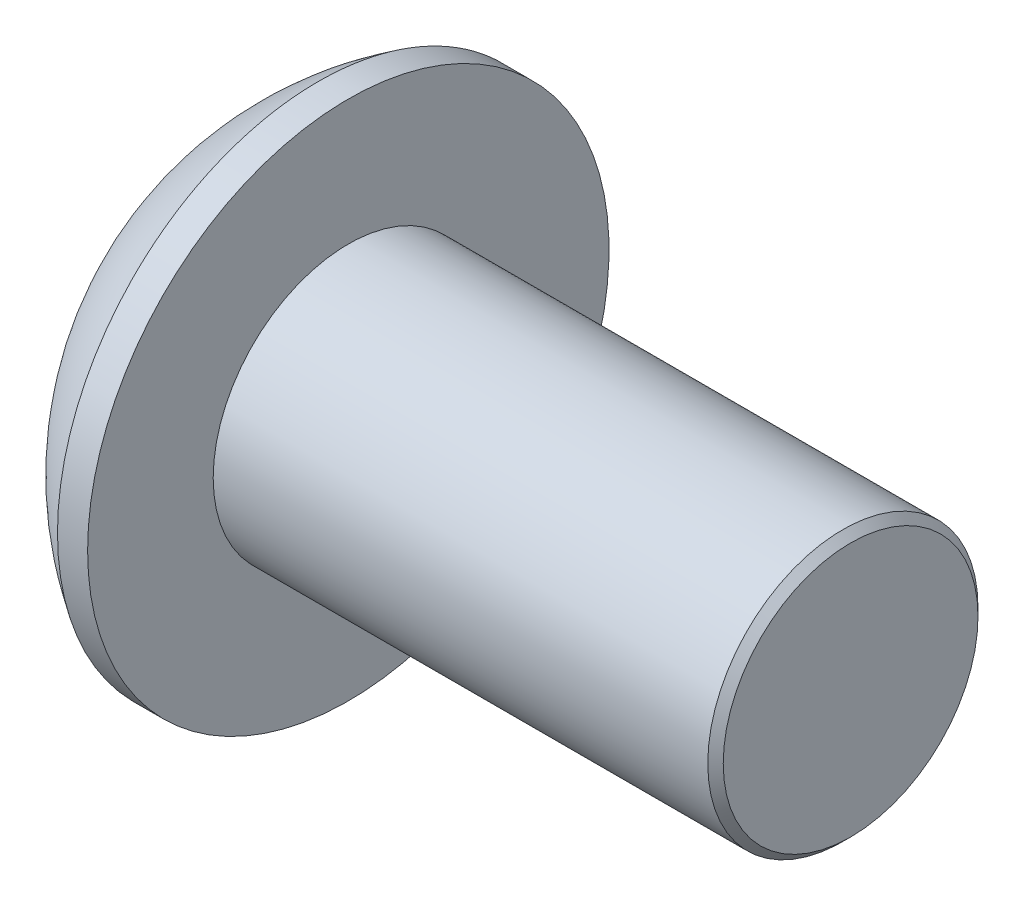
ISO-10303-21;
HEADER;
FILE_DESCRIPTION(('STEP AP214'),'2;1');
FILE_NAME('part.step','',(''),(''),'','','');
FILE_SCHEMA(('AUTOMOTIVE_DESIGN { 1 0 10303 214 1 1 1 1 }'));
ENDSEC;
DATA;
#1=APPLICATION_CONTEXT('core data for automotive mechanical design processes');
#2=APPLICATION_PROTOCOL_DEFINITION('international standard','automotive_design',2000,#1);
#3=PRODUCT_CONTEXT('',#1,'mechanical');
#4=PRODUCT('Part','Part','',(#3));
#5=PRODUCT_RELATED_PRODUCT_CATEGORY('part','',(#4));
#6=PRODUCT_DEFINITION_FORMATION('','',#4);
#7=PRODUCT_DEFINITION_CONTEXT('part definition',#1,'design');
#8=PRODUCT_DEFINITION('design','',#6,#7);
#9=PRODUCT_DEFINITION_SHAPE('','',#8);
#10=(LENGTH_UNIT() NAMED_UNIT(*) SI_UNIT(.MILLI.,.METRE.));
#11=(NAMED_UNIT(*) PLANE_ANGLE_UNIT() SI_UNIT($,.RADIAN.));
#12=(NAMED_UNIT(*) SI_UNIT($,.STERADIAN.) SOLID_ANGLE_UNIT());
#13=UNCERTAINTY_MEASURE_WITH_UNIT(LENGTH_MEASURE(1.E-05),#10,'distance_accuracy_value','');
#14=(GEOMETRIC_REPRESENTATION_CONTEXT(3) GLOBAL_UNCERTAINTY_ASSIGNED_CONTEXT((#13)) GLOBAL_UNIT_ASSIGNED_CONTEXT((#10,
#11,#12)) REPRESENTATION_CONTEXT('',''));
#15=CARTESIAN_POINT('',(0.,0.,0.));
#16=DIRECTION('',(0.,0.,1.));
#17=DIRECTION('',(1.,0.,0.));
#18=AXIS2_PLACEMENT_3D('',#15,#16,#17);
#19=CARTESIAN_POINT('',(1.32080000000034,0.,0.));
#20=DIRECTION('',(-1.,0.,0.));
#21=DIRECTION('',(0.,0.,1.));
#22=AXIS2_PLACEMENT_3D('',#19,#20,#21);
#23=CONICAL_SURFACE('',#22,1.1937999999998,1.04719755119608);
#24=CARTESIAN_POINT('',(2.01004075135902,0.,4.44089209850063E-13));
#25=VERTEX_POINT('',#24);
#26=VERTEX_LOOP('',#25);
#27=FACE_BOUND('',#26,.T.);
#28=CARTESIAN_POINT('',(1.32080000000009,0.,0.));
#29=DIRECTION('',(-1.,0.,0.));
#30=DIRECTION('',(0.,0.,1.));
#31=AXIS2_PLACEMENT_3D('',#28,#29,#30);
#32=CIRCLE('',#31,1.19380000000024);
#33=CARTESIAN_POINT('',(1.32080000000004,0.,1.19380000000012));
#34=VERTEX_POINT('',#33);
#35=CARTESIAN_POINT('',(1.32080000000004,-1.03386112703797,0.596900000000061));
#36=VERTEX_POINT('',#35);
#37=EDGE_CURVE('E20',#34,#36,#32,.F.);
#38=ORIENTED_EDGE('',*,*,#37,.F.);
#39=CARTESIAN_POINT('',(1.32080000000009,0.,0.));
#40=DIRECTION('',(-1.,0.,0.));
#41=DIRECTION('',(0.,0.,1.));
#42=AXIS2_PLACEMENT_3D('',#39,#40,#41);
#43=CIRCLE('',#42,1.19380000000024);
#44=CARTESIAN_POINT('',(1.32080000000004,1.03386112703797,0.596900000000063));
#45=VERTEX_POINT('',#44);
#46=EDGE_CURVE('E90',#45,#34,#43,.F.);
#47=ORIENTED_EDGE('',*,*,#46,.F.);
#48=CARTESIAN_POINT('',(1.32080000000009,0.,0.));
#49=DIRECTION('',(-1.,0.,0.));
#50=DIRECTION('',(0.,0.,1.));
#51=AXIS2_PLACEMENT_3D('',#48,#49,#50);
#52=CIRCLE('',#51,1.19380000000024);
#53=CARTESIAN_POINT('',(1.32080000000004,1.03386112703797,-0.596900000000063));
#54=VERTEX_POINT('',#53);
#55=EDGE_CURVE('E106',#54,#45,#52,.F.);
#56=ORIENTED_EDGE('',*,*,#55,.F.);
#57=CARTESIAN_POINT('',(1.32080000000009,0.,0.));
#58=DIRECTION('',(-1.,0.,0.));
#59=DIRECTION('',(0.,0.,1.));
#60=AXIS2_PLACEMENT_3D('',#57,#58,#59);
#61=CIRCLE('',#60,1.19380000000024);
#62=CARTESIAN_POINT('',(1.32080000000004,1.49420287879031E-12,-1.19380000000012));
#63=VERTEX_POINT('',#62);
#64=EDGE_CURVE('E444',#63,#54,#61,.F.);
#65=ORIENTED_EDGE('',*,*,#64,.F.);
#66=CARTESIAN_POINT('',(1.32080000000009,0.,0.));
#67=DIRECTION('',(-1.,0.,0.));
#68=DIRECTION('',(0.,0.,1.));
#69=AXIS2_PLACEMENT_3D('',#66,#67,#68);
#70=CIRCLE('',#69,1.19380000000024);
#71=CARTESIAN_POINT('',(1.32080000000004,-1.03386112703797,-0.596900000000062));
#72=VERTEX_POINT('',#71);
#73=EDGE_CURVE('E447',#72,#63,#70,.F.);
#74=ORIENTED_EDGE('',*,*,#73,.F.);
#75=CARTESIAN_POINT('',(1.32080000000009,0.,0.));
#76=DIRECTION('',(-1.,0.,0.));
#77=DIRECTION('',(0.,0.,1.));
#78=AXIS2_PLACEMENT_3D('',#75,#76,#77);
#79=CIRCLE('',#78,1.19380000000024);
#80=EDGE_CURVE('E93',#36,#72,#79,.F.);
#81=ORIENTED_EDGE('',*,*,#80,.F.);
#82=EDGE_LOOP('',(#38,#47,#56,#65,#74,#81));
#83=FACE_BOUND('',#82,.T.);
#84=ADVANCED_FACE('F17',(#27,#83),#23,.F.);
#85=CARTESIAN_POINT('',(1.3208,0.,2.3876));
#86=DIRECTION('',(-1.,0.,0.));
#87=DIRECTION('',(0.,0.,1.));
#88=AXIS2_PLACEMENT_3D('',#85,#86,#87);
#89=PLANE('',#88);
#90=DIRECTION('',(0.,1.,0.));
#91=VECTOR('',#90,1.);
#92=CARTESIAN_POINT('',(1.3208,-0.689240751358576,1.1938));
#93=LINE('',#92,#91);
#94=CARTESIAN_POINT('',(1.3208,-0.689240751358576,1.1938));
#95=VERTEX_POINT('',#94);
#96=EDGE_CURVE('E109',#34,#95,#93,.F.);
#97=ORIENTED_EDGE('',*,*,#96,.F.);
#98=ORIENTED_EDGE('',*,*,#37,.T.);
#99=DIRECTION('',(0.,0.5,0.866025403784439));
#100=VECTOR('',#99,1.);
#101=CARTESIAN_POINT('',(1.3208,-1.37848150271715,0.));
#102=LINE('',#101,#100);
#103=EDGE_CURVE('E112',#95,#36,#102,.F.);
#104=ORIENTED_EDGE('',*,*,#103,.F.);
#105=EDGE_LOOP('',(#97,#98,#104));
#106=FACE_BOUND('',#105,.T.);
#107=ADVANCED_FACE('F110',(#106),#89,.T.);
#108=CARTESIAN_POINT('',(1.3208,0.,2.3876));
#109=DIRECTION('',(-1.,0.,0.));
#110=DIRECTION('',(0.,0.,1.));
#111=AXIS2_PLACEMENT_3D('',#108,#109,#110);
#112=PLANE('',#111);
#113=DIRECTION('',(0.,0.5,0.866025403784439));
#114=VECTOR('',#113,1.);
#115=CARTESIAN_POINT('',(1.3208,-1.37848150271715,0.));
#116=LINE('',#115,#114);
#117=CARTESIAN_POINT('',(1.3208,-1.37848150271715,0.));
#118=VERTEX_POINT('',#117);
#119=EDGE_CURVE('E172',#36,#118,#116,.F.);
#120=ORIENTED_EDGE('',*,*,#119,.F.);
#121=ORIENTED_EDGE('',*,*,#80,.T.);
#122=DIRECTION('',(0.,-0.5,0.866025403784439));
#123=VECTOR('',#122,1.);
#124=CARTESIAN_POINT('',(1.3208,-0.689240751358576,-1.1938));
#125=LINE('',#124,#123);
#126=EDGE_CURVE('E160',#118,#72,#125,.F.);
#127=ORIENTED_EDGE('',*,*,#126,.F.);
#128=EDGE_LOOP('',(#120,#121,#127));
#129=FACE_BOUND('',#128,.T.);
#130=ADVANCED_FACE('F249',(#129),#112,.T.);
#131=CARTESIAN_POINT('',(1.3208,0.,2.3876));
#132=DIRECTION('',(-1.,0.,0.));
#133=DIRECTION('',(0.,0.,1.));
#134=AXIS2_PLACEMENT_3D('',#131,#132,#133);
#135=PLANE('',#134);
#136=DIRECTION('',(0.,-0.5,0.866025403784439));
#137=VECTOR('',#136,1.);
#138=CARTESIAN_POINT('',(1.3208,-0.689240751358576,-1.1938));
#139=LINE('',#138,#137);
#140=CARTESIAN_POINT('',(1.3208,-0.689240751358576,-1.1938));
#141=VERTEX_POINT('',#140);
#142=EDGE_CURVE('E157',#72,#141,#139,.F.);
#143=ORIENTED_EDGE('',*,*,#142,.F.);
#144=ORIENTED_EDGE('',*,*,#73,.T.);
#145=DIRECTION('',(0.,-1.,0.));
#146=VECTOR('',#145,1.);
#147=CARTESIAN_POINT('',(1.3208,0.689240751358575,-1.1938));
#148=LINE('',#147,#146);
#149=EDGE_CURVE('E144',#141,#63,#148,.F.);
#150=ORIENTED_EDGE('',*,*,#149,.F.);
#151=EDGE_LOOP('',(#143,#144,#150));
#152=FACE_BOUND('',#151,.T.);
#153=ADVANCED_FACE('F245',(#152),#135,.T.);
#154=CARTESIAN_POINT('',(1.3208,0.,2.3876));
#155=DIRECTION('',(-1.,0.,0.));
#156=DIRECTION('',(0.,0.,1.));
#157=AXIS2_PLACEMENT_3D('',#154,#155,#156);
#158=PLANE('',#157);
#159=DIRECTION('',(0.,-1.,0.));
#160=VECTOR('',#159,1.);
#161=CARTESIAN_POINT('',(1.3208,0.689240751358575,-1.1938));
#162=LINE('',#161,#160);
#163=CARTESIAN_POINT('',(1.3208,0.689240751358575,-1.1938));
#164=VERTEX_POINT('',#163);
#165=EDGE_CURVE('E141',#63,#164,#162,.F.);
#166=ORIENTED_EDGE('',*,*,#165,.F.);
#167=ORIENTED_EDGE('',*,*,#64,.T.);
#168=DIRECTION('',(0.,-0.500000000000001,-0.866025403784438));
#169=VECTOR('',#168,1.);
#170=CARTESIAN_POINT('',(1.3208,1.37848150271715,0.));
#171=LINE('',#170,#169);
#172=EDGE_CURVE('E129',#164,#54,#171,.F.);
#173=ORIENTED_EDGE('',*,*,#172,.F.);
#174=EDGE_LOOP('',(#166,#167,#173));
#175=FACE_BOUND('',#174,.T.);
#176=ADVANCED_FACE('F241',(#175),#158,.T.);
#177=CARTESIAN_POINT('',(1.3208,0.,2.3876));
#178=DIRECTION('',(-1.,0.,0.));
#179=DIRECTION('',(0.,0.,1.));
#180=AXIS2_PLACEMENT_3D('',#177,#178,#179);
#181=PLANE('',#180);
#182=DIRECTION('',(0.,-0.500000000000001,-0.866025403784438));
#183=VECTOR('',#182,1.);
#184=CARTESIAN_POINT('',(1.3208,1.37848150271715,0.));
#185=LINE('',#184,#183);
#186=CARTESIAN_POINT('',(1.3208,1.37848150271715,0.));
#187=VERTEX_POINT('',#186);
#188=EDGE_CURVE('E126',#54,#187,#185,.F.);
#189=ORIENTED_EDGE('',*,*,#188,.F.);
#190=ORIENTED_EDGE('',*,*,#55,.T.);
#191=DIRECTION('',(0.,0.500000000000001,-0.866025403784438));
#192=VECTOR('',#191,1.);
#193=CARTESIAN_POINT('',(1.3208,0.689240751358575,1.1938));
#194=LINE('',#193,#192);
#195=EDGE_CURVE('E149',#187,#45,#194,.F.);
#196=ORIENTED_EDGE('',*,*,#195,.F.);
#197=EDGE_LOOP('',(#189,#190,#196));
#198=FACE_BOUND('',#197,.T.);
#199=ADVANCED_FACE('F238',(#198),#181,.T.);
#200=CARTESIAN_POINT('',(1.3208,0.,2.3876));
#201=DIRECTION('',(-1.,0.,0.));
#202=DIRECTION('',(0.,0.,1.));
#203=AXIS2_PLACEMENT_3D('',#200,#201,#202);
#204=PLANE('',#203);
#205=DIRECTION('',(0.,0.500000000000001,-0.866025403784438));
#206=VECTOR('',#205,1.);
#207=CARTESIAN_POINT('',(1.3208,0.689240751358575,1.1938));
#208=LINE('',#207,#206);
#209=CARTESIAN_POINT('',(1.3208,0.689240751358575,1.1938));
#210=VERTEX_POINT('',#209);
#211=EDGE_CURVE('E104',#45,#210,#208,.F.);
#212=ORIENTED_EDGE('',*,*,#211,.F.);
#213=ORIENTED_EDGE('',*,*,#46,.T.);
#214=DIRECTION('',(0.,1.,0.));
#215=VECTOR('',#214,1.);
#216=CARTESIAN_POINT('',(1.3208,-0.689240751358576,1.1938));
#217=LINE('',#216,#215);
#218=EDGE_CURVE('E101',#210,#34,#217,.F.);
#219=ORIENTED_EDGE('',*,*,#218,.F.);
#220=EDGE_LOOP('',(#212,#213,#219));
#221=FACE_BOUND('',#220,.T.);
#222=ADVANCED_FACE('F99',(#221),#204,.T.);
#223=CARTESIAN_POINT('',(1.3208,-0.689240751358576,1.1938));
#224=DIRECTION('',(0.,0.,-1.));
#225=DIRECTION('',(0.,1.,0.));
#226=AXIS2_PLACEMENT_3D('',#223,#224,#225);
#227=PLANE('',#226);
#228=DIRECTION('',(0.,1.,0.));
#229=VECTOR('',#228,1.);
#230=CARTESIAN_POINT('',(0.,0.,1.1938));
#231=LINE('',#230,#229);
#232=CARTESIAN_POINT('',(0.,0.689240751358575,1.1938));
#233=VERTEX_POINT('',#232);
#234=CARTESIAN_POINT('',(0.,-0.689240751358576,1.1938));
#235=VERTEX_POINT('',#234);
#236=EDGE_CURVE('E133',#233,#235,#231,.F.);
#237=ORIENTED_EDGE('',*,*,#236,.F.);
#238=DIRECTION('',(1.,0.,0.));
#239=VECTOR('',#238,1.);
#240=CARTESIAN_POINT('',(1.3208,0.689240751358575,1.1938));
#241=LINE('',#240,#239);
#242=EDGE_CURVE('E118',#210,#233,#241,.F.);
#243=ORIENTED_EDGE('',*,*,#242,.F.);
#244=ORIENTED_EDGE('',*,*,#218,.T.);
#245=ORIENTED_EDGE('',*,*,#96,.T.);
#246=DIRECTION('',(1.,0.,0.));
#247=VECTOR('',#246,1.);
#248=CARTESIAN_POINT('',(1.3208,-0.689240751358576,1.1938));
#249=LINE('',#248,#247);
#250=EDGE_CURVE('E169',#235,#95,#249,.T.);
#251=ORIENTED_EDGE('',*,*,#250,.F.);
#252=EDGE_LOOP('',(#237,#243,#244,#245,#251));
#253=FACE_BOUND('',#252,.T.);
#254=ADVANCED_FACE('F116',(#253),#227,.T.);
#255=CARTESIAN_POINT('',(1.3208,-1.37848150271715,0.));
#256=DIRECTION('',(0.,0.866025403784439,-0.5));
#257=DIRECTION('',(0.,0.5,0.866025403784439));
#258=AXIS2_PLACEMENT_3D('',#255,#256,#257);
#259=PLANE('',#258);
#260=DIRECTION('',(0.,-0.5,-0.866025403784439));
#261=VECTOR('',#260,1.);
#262=CARTESIAN_POINT('',(0.,-0.689240751358576,1.1938));
#263=LINE('',#262,#261);
#264=CARTESIAN_POINT('',(0.,-1.37848150271715,0.));
#265=VERTEX_POINT('',#264);
#266=EDGE_CURVE('E431',#235,#265,#263,.T.);
#267=ORIENTED_EDGE('',*,*,#266,.F.);
#268=ORIENTED_EDGE('',*,*,#250,.T.);
#269=ORIENTED_EDGE('',*,*,#103,.T.);
#270=ORIENTED_EDGE('',*,*,#119,.T.);
#271=DIRECTION('',(1.,0.,0.));
#272=VECTOR('',#271,1.);
#273=CARTESIAN_POINT('',(1.3208,-1.37848150271715,0.));
#274=LINE('',#273,#272);
#275=EDGE_CURVE('E154',#265,#118,#274,.T.);
#276=ORIENTED_EDGE('',*,*,#275,.F.);
#277=EDGE_LOOP('',(#267,#268,#269,#270,#276));
#278=FACE_BOUND('',#277,.T.);
#279=ADVANCED_FACE('F229',(#278),#259,.T.);
#280=CARTESIAN_POINT('',(1.3208,-0.689240751358576,-1.1938));
#281=DIRECTION('',(0.,0.866025403784439,0.5));
#282=DIRECTION('',(0.,-0.5,0.866025403784439));
#283=AXIS2_PLACEMENT_3D('',#280,#281,#282);
#284=PLANE('',#283);
#285=DIRECTION('',(0.,0.5,-0.866025403784439));
#286=VECTOR('',#285,1.);
#287=CARTESIAN_POINT('',(0.,-1.37848150271715,0.));
#288=LINE('',#287,#286);
#289=CARTESIAN_POINT('',(0.,-0.689240751358576,-1.1938));
#290=VERTEX_POINT('',#289);
#291=EDGE_CURVE('E428',#265,#290,#288,.T.);
#292=ORIENTED_EDGE('',*,*,#291,.F.);
#293=ORIENTED_EDGE('',*,*,#275,.T.);
#294=ORIENTED_EDGE('',*,*,#126,.T.);
#295=ORIENTED_EDGE('',*,*,#142,.T.);
#296=DIRECTION('',(1.,0.,0.));
#297=VECTOR('',#296,1.);
#298=CARTESIAN_POINT('',(1.3208,-0.689240751358576,-1.1938));
#299=LINE('',#298,#297);
#300=EDGE_CURVE('E138',#290,#141,#299,.T.);
#301=ORIENTED_EDGE('',*,*,#300,.F.);
#302=EDGE_LOOP('',(#292,#293,#294,#295,#301));
#303=FACE_BOUND('',#302,.T.);
#304=ADVANCED_FACE('F225',(#303),#284,.T.);
#305=CARTESIAN_POINT('',(1.3208,0.689240751358575,-1.1938));
#306=DIRECTION('',(0.,0.,1.));
#307=DIRECTION('',(0.,-1.,0.));
#308=AXIS2_PLACEMENT_3D('',#305,#306,#307);
#309=PLANE('',#308);
#310=DIRECTION('',(0.,1.,0.));
#311=VECTOR('',#310,1.);
#312=CARTESIAN_POINT('',(0.,0.,-1.1938));
#313=LINE('',#312,#311);
#314=CARTESIAN_POINT('',(0.,0.689240751358575,-1.1938));
#315=VERTEX_POINT('',#314);
#316=EDGE_CURVE('E425',#290,#315,#313,.T.);
#317=ORIENTED_EDGE('',*,*,#316,.F.);
#318=ORIENTED_EDGE('',*,*,#300,.T.);
#319=ORIENTED_EDGE('',*,*,#149,.T.);
#320=ORIENTED_EDGE('',*,*,#165,.T.);
#321=DIRECTION('',(1.,0.,0.));
#322=VECTOR('',#321,1.);
#323=CARTESIAN_POINT('',(1.3208,0.689240751358575,-1.1938));
#324=LINE('',#323,#322);
#325=EDGE_CURVE('E128',#315,#164,#324,.T.);
#326=ORIENTED_EDGE('',*,*,#325,.F.);
#327=EDGE_LOOP('',(#317,#318,#319,#320,#326));
#328=FACE_BOUND('',#327,.T.);
#329=ADVANCED_FACE('F222',(#328),#309,.T.);
#330=CARTESIAN_POINT('',(1.3208,1.37848150271715,0.));
#331=DIRECTION('',(0.,-0.866025403784438,0.500000000000001));
#332=DIRECTION('',(0.,-0.500000000000001,-0.866025403784438));
#333=AXIS2_PLACEMENT_3D('',#330,#331,#332);
#334=PLANE('',#333);
#335=DIRECTION('',(0.,0.500000000000001,0.866025403784438));
#336=VECTOR('',#335,1.);
#337=CARTESIAN_POINT('',(0.,0.689240751358575,-1.1938));
#338=LINE('',#337,#336);
#339=CARTESIAN_POINT('',(0.,1.37848150271715,0.));
#340=VERTEX_POINT('',#339);
#341=EDGE_CURVE('E422',#315,#340,#338,.T.);
#342=ORIENTED_EDGE('',*,*,#341,.F.);
#343=ORIENTED_EDGE('',*,*,#325,.T.);
#344=ORIENTED_EDGE('',*,*,#172,.T.);
#345=ORIENTED_EDGE('',*,*,#188,.T.);
#346=DIRECTION('',(1.,0.,0.));
#347=VECTOR('',#346,1.);
#348=CARTESIAN_POINT('',(1.3208,1.37848150271715,0.));
#349=LINE('',#348,#347);
#350=EDGE_CURVE('E35',#340,#187,#349,.T.);
#351=ORIENTED_EDGE('',*,*,#350,.F.);
#352=EDGE_LOOP('',(#342,#343,#344,#345,#351));
#353=FACE_BOUND('',#352,.T.);
#354=ADVANCED_FACE('F218',(#353),#334,.T.);
#355=CARTESIAN_POINT('',(1.3208,0.689240751358575,1.1938));
#356=DIRECTION('',(0.,-0.866025403784438,-0.500000000000001));
#357=DIRECTION('',(0.,0.500000000000001,-0.866025403784438));
#358=AXIS2_PLACEMENT_3D('',#355,#356,#357);
#359=PLANE('',#358);
#360=DIRECTION('',(0.,-0.500000000000001,0.866025403784438));
#361=VECTOR('',#360,1.);
#362=CARTESIAN_POINT('',(0.,1.37848150271715,0.));
#363=LINE('',#362,#361);
#364=EDGE_CURVE('E204',#340,#233,#363,.T.);
#365=ORIENTED_EDGE('',*,*,#364,.F.);
#366=ORIENTED_EDGE('',*,*,#350,.T.);
#367=ORIENTED_EDGE('',*,*,#195,.T.);
#368=ORIENTED_EDGE('',*,*,#211,.T.);
#369=ORIENTED_EDGE('',*,*,#242,.T.);
#370=EDGE_LOOP('',(#365,#366,#367,#368,#369));
#371=FACE_BOUND('',#370,.T.);
#372=ADVANCED_FACE('F214',(#371),#359,.T.);
#373=CARTESIAN_POINT('',(0.,0.,0.));
#374=DIRECTION('',(-1.,0.,0.));
#375=DIRECTION('',(0.,0.,1.));
#376=AXIS2_PLACEMENT_3D('',#373,#374,#375);
#377=PLANE('',#376);
#378=ORIENTED_EDGE('',*,*,#341,.T.);
#379=ORIENTED_EDGE('',*,*,#364,.T.);
#380=ORIENTED_EDGE('',*,*,#236,.T.);
#381=ORIENTED_EDGE('',*,*,#266,.T.);
#382=ORIENTED_EDGE('',*,*,#291,.T.);
#383=ORIENTED_EDGE('',*,*,#316,.T.);
#384=EDGE_LOOP('',(#378,#379,#380,#381,#382,#383));
#385=FACE_BOUND('',#384,.T.);
#386=CARTESIAN_POINT('',(0.,1.647825,0.));
#387=CARTESIAN_POINT('',(1.62843325243939E-13,1.64781976319874,0.0924902039777531));
#388=CARTESIAN_POINT('',(1.32817714039063E-13,1.63999511633709,0.18514501432637));
#389=CARTESIAN_POINT('',(0.,1.6167119250047,0.322075808080014));
#390=CARTESIAN_POINT('',(-1.58022641874245E-13,1.60700618770234,0.367435533396361));
#391=CARTESIAN_POINT('',(1.59018859991811E-13,1.58380101865853,0.45722093569514));
#392=CARTESIAN_POINT('',(5.68558332013136E-13,1.5702985083103,0.501645823115263));
#393=CARTESIAN_POINT('',(9.36160216988718E-13,1.52428156574313,0.632817459278967));
#394=CARTESIAN_POINT('',(0.,1.48621992666366,0.717681965518644));
#395=CARTESIAN_POINT('',(0.,1.39637079695658,0.879809706624017));
#396=CARTESIAN_POINT('',(7.80943703218082E-13,1.34458278455109,0.957072652379994));
#397=CARTESIAN_POINT('',(4.86302224883105E-13,1.25777784714521,1.06558770210238));
#398=CARTESIAN_POINT('',(1.33418473686991E-13,1.22729946114793,1.10054993332365));
#399=CARTESIAN_POINT('',(-1.32422894579168E-13,1.16354004969106,1.16775237388221));
#400=CARTESIAN_POINT('',(0.,1.13026175473033,1.19999517515816));
#401=CARTESIAN_POINT('',(0.,1.02649304340867,1.29236218866442));
#402=CARTESIAN_POINT('',(0.,0.952049986714078,1.34814848277713));
#403=CARTESIAN_POINT('',(0.,0.794895196754068,1.44639825105766));
#404=CARTESIAN_POINT('',(0.,0.712183775431296,1.48886222758992));
#405=CARTESIAN_POINT('',(0.,0.54079662426573,1.55930919813143));
#406=CARTESIAN_POINT('',(0.,0.452120958135285,1.58729234680268));
#407=CARTESIAN_POINT('',(0.,0.271332331080316,1.62797191307413));
#408=CARTESIAN_POINT('',(0.,0.179219351801788,1.64066824903626));
#409=CARTESIAN_POINT('',(0.,-0.00583077027840824,1.65041748705409));
#410=CARTESIAN_POINT('',(0.,-0.0987679130800775,1.64747038910979));
#411=CARTESIAN_POINT('',(0.,-0.282830196388824,1.62601274134436));
#412=CARTESIAN_POINT('',(0.,-0.373955346570017,1.60750227463794));
#413=CARTESIAN_POINT('',(0.,-0.551796068178803,1.55545413364524));
#414=CARTESIAN_POINT('',(0.,-0.638511592498165,1.52191629885844));
#415=CARTESIAN_POINT('',(0.,-0.805120175533153,1.44072378052347));
#416=CARTESIAN_POINT('',(0.,-0.885012976819956,1.39306856461393));
#417=CARTESIAN_POINT('',(0.,-0.99791287958836,1.31211658756413));
#418=CARTESIAN_POINT('',(0.,-1.0343949246834,1.28354906167734));
#419=CARTESIAN_POINT('',(0.,-1.10486279842069,1.22341829303709));
#420=CARTESIAN_POINT('',(0.,-1.13884618403291,1.19185218578117));
#421=CARTESIAN_POINT('',(0.,-1.23657300939908,1.09305906467359));
#422=CARTESIAN_POINT('',(0.,-1.29619288399357,1.02166556658612));
#423=CARTESIAN_POINT('',(0.,-1.40258050817756,0.869876423478033));
#424=CARTESIAN_POINT('',(0.,-1.44934874627766,0.789481120793478));
#425=CARTESIAN_POINT('',(0.,-1.50889406070375,0.663870959313341));
#426=CARTESIAN_POINT('',(0.,-1.52698985473586,0.621110806760428));
#427=CARTESIAN_POINT('',(0.,-1.55950093966664,0.534260776864332));
#428=CARTESIAN_POINT('',(-1.05044019424564E-13,-1.57391920916438,0.490172008203169));
#429=CARTESIAN_POINT('',(2.10836025953584E-13,-1.61146177909579,0.356445777718598));
#430=CARTESIAN_POINT('',(1.14534248982926E-12,-1.62897899568075,0.265126085962907));
#431=CARTESIAN_POINT('',(4.35443048045798E-13,-1.64174347214909,0.144386595969389));
#432=CARTESIAN_POINT('',(1.22073961001729E-13,-1.64402207668916,0.115560405797875));
#433=CARTESIAN_POINT('',(-1.21206599263816E-13,-1.64706365940121,0.05782817572527));
#434=CARTESIAN_POINT('',(0.,-1.64782663757319,0.0289221358241781));
#435=CARTESIAN_POINT('',(1.63470671040131E-13,-1.64781976319874,-0.0924902039777539));
#436=CARTESIAN_POINT('',(1.32938325409504E-13,-1.6399951163371,-0.185145014326371));
#437=CARTESIAN_POINT('',(0.,-1.61671192500471,-0.322075808080014));
#438=CARTESIAN_POINT('',(-1.58046531374201E-13,-1.60700618770235,-0.367435533396361));
#439=CARTESIAN_POINT('',(1.59042768918662E-13,-1.58380101865854,-0.457220935695141));
#440=CARTESIAN_POINT('',(5.68593444024776E-13,-1.57029850831031,-0.501645823115264));
#441=CARTESIAN_POINT('',(9.36090160340248E-13,-1.52428156574314,-0.632817459278967));
#442=CARTESIAN_POINT('',(0.,-1.48621992666367,-0.717681965518644));
#443=CARTESIAN_POINT('',(0.,-1.39637079695659,-0.879809706624018));
#444=CARTESIAN_POINT('',(7.82171681746037E-13,-1.3445827845511,-0.957072652379996));
#445=CARTESIAN_POINT('',(4.86989041954753E-13,-1.25777784714522,-1.06558770210238));
#446=CARTESIAN_POINT('',(1.33607894493546E-13,-1.22729946114794,-1.10054993332365));
#447=CARTESIAN_POINT('',(-1.32612132755536E-13,-1.16354004969107,-1.16775237388221));
#448=CARTESIAN_POINT('',(0.,-1.13026175473034,-1.19999517515816));
#449=CARTESIAN_POINT('',(0.,-1.02649304340868,-1.29236218866442));
#450=CARTESIAN_POINT('',(0.,-0.952049986714087,-1.34814848277713));
#451=CARTESIAN_POINT('',(0.,-0.794895196754077,-1.44639825105766));
#452=CARTESIAN_POINT('',(0.,-0.712183775431305,-1.48886222758992));
#453=CARTESIAN_POINT('',(0.,-0.540796624265738,-1.55930919813143));
#454=CARTESIAN_POINT('',(0.,-0.452120958135293,-1.58729234680268));
#455=CARTESIAN_POINT('',(0.,-0.271332331080324,-1.62797191307413));
#456=CARTESIAN_POINT('',(0.,-0.179219351801796,-1.64066824903626));
#457=CARTESIAN_POINT('',(0.,0.00583077027840062,-1.65041748705409));
#458=CARTESIAN_POINT('',(0.,0.0987679130800699,-1.64747038910979));
#459=CARTESIAN_POINT('',(0.,0.282830196388817,-1.62601274134436));
#460=CARTESIAN_POINT('',(0.,0.373955346570011,-1.60750227463794));
#461=CARTESIAN_POINT('',(0.,0.551796068178797,-1.55545413364524));
#462=CARTESIAN_POINT('',(0.,0.638511592498159,-1.52191629885844));
#463=CARTESIAN_POINT('',(0.,0.805120175533146,-1.44072378052347));
#464=CARTESIAN_POINT('',(0.,0.885012976819948,-1.39306856461393));
#465=CARTESIAN_POINT('',(0.,0.997912879588352,-1.31211658756413));
#466=CARTESIAN_POINT('',(0.,1.03439492468339,-1.28354906167734));
#467=CARTESIAN_POINT('',(0.,1.10486279842068,-1.22341829303709));
#468=CARTESIAN_POINT('',(0.,1.1388461840329,-1.19185218578117));
#469=CARTESIAN_POINT('',(0.,1.23657300939908,-1.09305906467359));
#470=CARTESIAN_POINT('',(0.,1.29619288399356,-1.02166556658612));
#471=CARTESIAN_POINT('',(0.,1.40258050817755,-0.869876423478033));
#472=CARTESIAN_POINT('',(0.,1.44934874627765,-0.789481120793477));
#473=CARTESIAN_POINT('',(0.,1.50889406070375,-0.663870959313341));
#474=CARTESIAN_POINT('',(0.,1.52698985473586,-0.621110806760428));
#475=CARTESIAN_POINT('',(0.,1.55950093966663,-0.534260776864332));
#476=CARTESIAN_POINT('',(-1.04884674939983E-13,1.57391920916437,-0.490172008203169));
#477=CARTESIAN_POINT('',(2.1051817248182E-13,1.61146177909579,-0.356445777718597));
#478=CARTESIAN_POINT('',(1.14364192322985E-12,1.62897899568074,-0.265126085962907));
#479=CARTESIAN_POINT('',(4.34836233513191E-13,1.64174347214908,-0.144386595969389));
#480=CARTESIAN_POINT('',(1.21944375722299E-13,1.64402207668915,-0.115560405797875));
#481=CARTESIAN_POINT('',(-1.21077013984386E-13,1.6470636594012,-0.0578281757252704));
#482=CARTESIAN_POINT('',(0.,1.64782663757318,-0.0289221358241788));
#483=CARTESIAN_POINT('',(0.,1.647825,0.));
#484=B_SPLINE_CURVE_WITH_KNOTS('',3,(#386,#387,#388,#389,#390,#391,#392,#393,#394,#395,#396,
#397,#398,#399,#400,#401,#402,#403,#404,#405,#406,#407,#408,#409,#410,#411,#412,#413,#414,#415,
#416,#417,#418,#419,#420,#421,#422,#423,#424,#425,#426,#427,#428,#429,#430,#431,#432,#433,#434,
#435,#436,#437,#438,#439,#440,#441,#442,#443,#444,#445,#446,#447,#448,#449,#450,#451,#452,#453,
#454,#455,#456,#457,#458,#459,#460,#461,#462,#463,#464,#465,#466,#467,#468,#469,#470,#471,#472,
#473,#474,#475,#476,#477,#478,#479,#480,#481,#482,#483),.UNSPECIFIED.,.T.,.F.,(4,2,2,2,2,2,2,2,
2,2,2,2,2,2,2,2,2,2,2,2,2,2,2,2,2,2,2,2,2,2,2,2,2,2,2,2,2,2,2,2,2,2,2,2,2,2,2,2,4),(0.,
0.277336029422426,0.416368541537111,0.555514114625599,0.833141970294987,1.11078038089036,
1.24978149120748,1.38864858351854,1.66629367015056,1.94392828594775,2.22155993641642,
2.49919306954937,2.77682620268234,3.05445785315102,3.3320924689482,3.6097375555799,
3.74860464789075,3.88760575820768,4.16524416880333,4.44287202447288,4.58201759756161,
4.72105010967662,4.99838613909883,5.08511046196677,5.17183478483477,5.4491708142572,
5.58820332637188,5.72734889946037,6.00497675512976,6.28261516572513,6.42161627604225,
6.56048336835331,6.83812845498533,7.11576307078252,7.39339472125119,7.67102785438415,
7.94866098751711,8.22629263798579,8.50392725378298,8.78157234041468,8.92043943272552,
9.05944054304245,9.3370789536381,9.61470680930765,9.75385238239638,9.8928848945114,
10.1702209239336,10.2569452468015,10.3436695696695),.UNSPECIFIED.);
#485=CARTESIAN_POINT('',(0.,1.647825,0.));
#486=VERTEX_POINT('',#485);
#487=EDGE_CURVE('E198',#486,#486,#484,.T.);
#488=ORIENTED_EDGE('',*,*,#487,.F.);
#489=EDGE_LOOP('',(#488));
#490=FACE_BOUND('',#489,.T.);
#491=ADVANCED_FACE('F210',(#385,#490),#377,.T.);
#492=CARTESIAN_POINT('',(3.50132362607759,0.,0.));
#493=DIRECTION('',(0.,1.,0.));
#494=DIRECTION('',(1.,0.,0.));
#495=AXIS2_PLACEMENT_3D('',#492,#493,#494);
#496=SPHERICAL_SURFACE('',#495,3.86970210289554);
#497=CARTESIAN_POINT('',(1.4732,0.,0.));
#498=DIRECTION('',(-1.,0.,0.));
#499=DIRECTION('',(0.,0.,1.));
#500=AXIS2_PLACEMENT_3D('',#497,#498,#499);
#501=CIRCLE('',#500,3.29565);
#502=CARTESIAN_POINT('',(1.4732,0.,3.29565));
#503=VERTEX_POINT('',#502);
#504=EDGE_CURVE('E195',#503,#503,#501,.F.);
#505=ORIENTED_EDGE('',*,*,#504,.F.);
#506=EDGE_LOOP('',(#505));
#507=FACE_BOUND('',#506,.T.);
#508=ORIENTED_EDGE('',*,*,#487,.T.);
#509=EDGE_LOOP('',(#508));
#510=FACE_BOUND('',#509,.T.);
#511=ADVANCED_FACE('F206',(#507,#510),#496,.T.);
#512=CARTESIAN_POINT('',(8.20420000000001,0.,0.));
#513=DIRECTION('',(-1.,0.,0.));
#514=DIRECTION('',(0.,0.,1.));
#515=AXIS2_PLACEMENT_3D('',#512,#513,#514);
#516=PLANE('',#515);
#517=CARTESIAN_POINT('',(8.20420000002287,0.,0.));
#518=DIRECTION('',(-1.,0.,0.));
#519=DIRECTION('',(0.,0.,1.));
#520=AXIS2_PLACEMENT_3D('',#517,#518,#519);
#521=CIRCLE('',#520,1.61036000002923);
#522=CARTESIAN_POINT('',(8.20420000002287,0.,1.61036000002923));
#523=VERTEX_POINT('',#522);
#524=EDGE_CURVE('E192',#523,#523,#521,.T.);
#525=ORIENTED_EDGE('',*,*,#524,.F.);
#526=EDGE_LOOP('',(#525));
#527=FACE_BOUND('',#526,.T.);
#528=ADVANCED_FACE('F277',(#527),#516,.F.);
#529=CARTESIAN_POINT('',(0.,0.,0.));
#530=DIRECTION('',(-1.,0.,0.));
#531=DIRECTION('',(0.,0.,1.));
#532=AXIS2_PLACEMENT_3D('',#529,#530,#531);
#533=CYLINDRICAL_SURFACE('',#532,3.29565);
#534=ORIENTED_EDGE('',*,*,#504,.T.);
#535=EDGE_LOOP('',(#534));
#536=FACE_BOUND('',#535,.T.);
#537=CARTESIAN_POINT('',(1.8542,0.,0.));
#538=DIRECTION('',(-1.,0.,0.));
#539=DIRECTION('',(0.,0.,1.));
#540=AXIS2_PLACEMENT_3D('',#537,#538,#539);
#541=CIRCLE('',#540,3.29565);
#542=CARTESIAN_POINT('',(1.8542,0.,3.29565));
#543=VERTEX_POINT('',#542);
#544=EDGE_CURVE('E189',#543,#543,#541,.T.);
#545=ORIENTED_EDGE('',*,*,#544,.T.);
#546=EDGE_LOOP('',(#545));
#547=FACE_BOUND('',#546,.T.);
#548=ADVANCED_FACE('F274',(#536,#547),#533,.T.);
#549=CARTESIAN_POINT('',(8.10641000003898,0.,0.));
#550=DIRECTION('',(-1.,0.,0.));
#551=DIRECTION('',(0.,0.,1.));
#552=AXIS2_PLACEMENT_3D('',#549,#550,#551);
#553=CONICAL_SURFACE('',#552,1.70815000001312,0.785398163397448);
#554=CARTESIAN_POINT('',(8.10641000000002,0.,0.));
#555=DIRECTION('',(-1.,0.,0.));
#556=DIRECTION('',(0.,0.,1.));
#557=AXIS2_PLACEMENT_3D('',#554,#555,#556);
#558=CIRCLE('',#557,1.70815);
#559=CARTESIAN_POINT('',(8.10641000000002,0.,1.70815));
#560=VERTEX_POINT('',#559);
#561=EDGE_CURVE('E26',#560,#560,#558,.T.);
#562=ORIENTED_EDGE('',*,*,#561,.F.);
#563=EDGE_LOOP('',(#562));
#564=FACE_BOUND('',#563,.T.);
#565=ORIENTED_EDGE('',*,*,#524,.T.);
#566=EDGE_LOOP('',(#565));
#567=FACE_BOUND('',#566,.T.);
#568=ADVANCED_FACE('F267',(#564,#567),#553,.T.);
#569=CARTESIAN_POINT('',(1.8542,1.70815,0.));
#570=DIRECTION('',(-1.,0.,0.));
#571=DIRECTION('',(0.,0.,1.));
#572=AXIS2_PLACEMENT_3D('',#569,#570,#571);
#573=PLANE('',#572);
#574=CARTESIAN_POINT('',(1.8542,0.,0.));
#575=DIRECTION('',(-1.,0.,0.));
#576=DIRECTION('',(0.,0.,1.));
#577=AXIS2_PLACEMENT_3D('',#574,#575,#576);
#578=CIRCLE('',#577,1.70815);
#579=CARTESIAN_POINT('',(1.8542,0.,1.70815));
#580=VERTEX_POINT('',#579);
#581=EDGE_CURVE('E11',#580,#580,#578,.F.);
#582=ORIENTED_EDGE('',*,*,#581,.F.);
#583=EDGE_LOOP('',(#582));
#584=FACE_BOUND('',#583,.T.);
#585=ORIENTED_EDGE('',*,*,#544,.F.);
#586=EDGE_LOOP('',(#585));
#587=FACE_BOUND('',#586,.T.);
#588=ADVANCED_FACE('F261',(#584,#587),#573,.F.);
#589=CARTESIAN_POINT('',(0.,0.,0.));
#590=DIRECTION('',(-1.,0.,0.));
#591=DIRECTION('',(0.,0.,1.));
#592=AXIS2_PLACEMENT_3D('',#589,#590,#591);
#593=CYLINDRICAL_SURFACE('',#592,1.70815);
#594=ORIENTED_EDGE('',*,*,#581,.T.);
#595=EDGE_LOOP('',(#594));
#596=FACE_BOUND('',#595,.T.);
#597=ORIENTED_EDGE('',*,*,#561,.T.);
#598=EDGE_LOOP('',(#597));
#599=FACE_BOUND('',#598,.T.);
#600=ADVANCED_FACE('F259',(#596,#599),#593,.T.);
#601=CLOSED_SHELL('',(#84,#107,#130,#153,#176,#199,#222,#254,#279,#304,#329,#354,#372,#491,#511,
#528,#548,#568,#588,#600));
#602=MANIFOLD_SOLID_BREP('B1',#601);
#603=ADVANCED_BREP_SHAPE_REPRESENTATION('',(#18,#602),#14);
#604=SHAPE_DEFINITION_REPRESENTATION(#9,#603);
ENDSEC;
END-ISO-10303-21;
